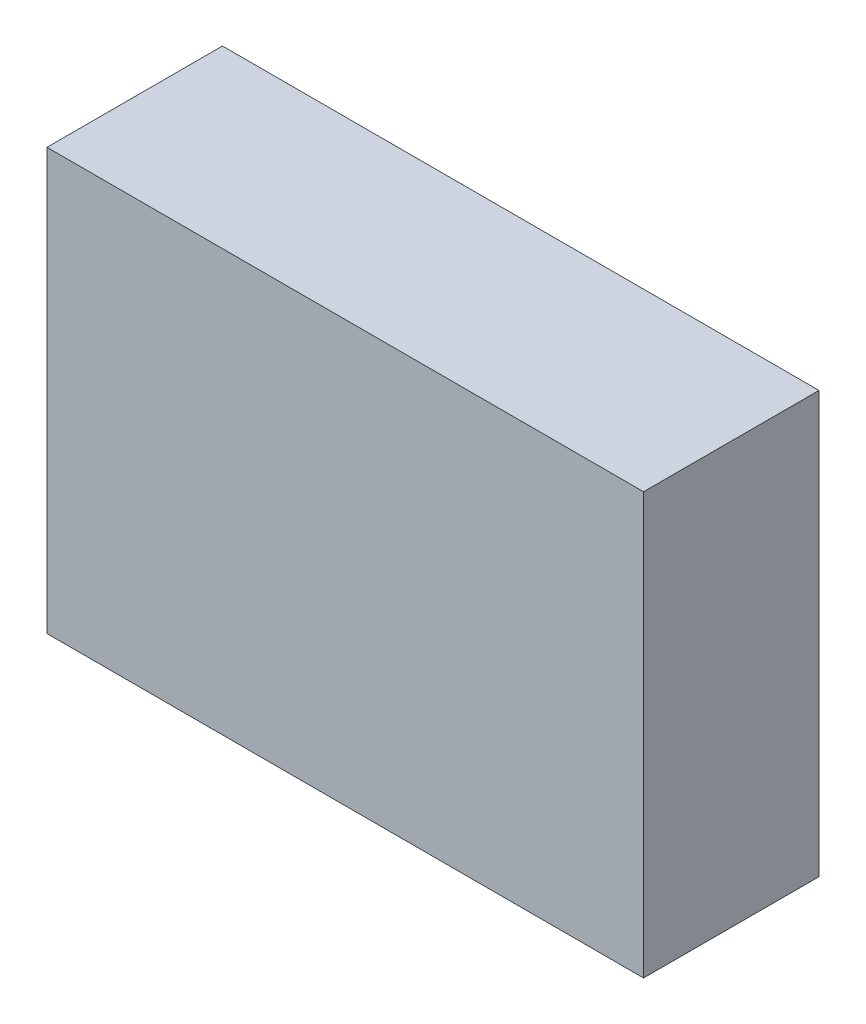
ISO-10303-21;
HEADER;
FILE_DESCRIPTION(('STEP AP214'),'2;1');
FILE_NAME('part.step','',(''),(''),'','','');
FILE_SCHEMA(('AUTOMOTIVE_DESIGN { 1 0 10303 214 1 1 1 1 }'));
ENDSEC;
DATA;
#1=APPLICATION_CONTEXT('core data for automotive mechanical design processes');
#2=APPLICATION_PROTOCOL_DEFINITION('international standard','automotive_design',2000,#1);
#3=PRODUCT_CONTEXT('',#1,'mechanical');
#4=PRODUCT('Part','Part','',(#3));
#5=PRODUCT_RELATED_PRODUCT_CATEGORY('part','',(#4));
#6=PRODUCT_DEFINITION_FORMATION('','',#4);
#7=PRODUCT_DEFINITION_CONTEXT('part definition',#1,'design');
#8=PRODUCT_DEFINITION('design','',#6,#7);
#9=PRODUCT_DEFINITION_SHAPE('','',#8);
#10=(LENGTH_UNIT() NAMED_UNIT(*) SI_UNIT(.MILLI.,.METRE.));
#11=(NAMED_UNIT(*) PLANE_ANGLE_UNIT() SI_UNIT($,.RADIAN.));
#12=(NAMED_UNIT(*) SI_UNIT($,.STERADIAN.) SOLID_ANGLE_UNIT());
#13=UNCERTAINTY_MEASURE_WITH_UNIT(LENGTH_MEASURE(1.E-05),#10,'distance_accuracy_value','');
#14=(GEOMETRIC_REPRESENTATION_CONTEXT(3) GLOBAL_UNCERTAINTY_ASSIGNED_CONTEXT((#13)) GLOBAL_UNIT_ASSIGNED_CONTEXT((#10,
#11,#12)) REPRESENTATION_CONTEXT('',''));
#15=CARTESIAN_POINT('',(0.,0.,0.));
#16=DIRECTION('',(0.,0.,1.));
#17=DIRECTION('',(1.,0.,0.));
#18=AXIS2_PLACEMENT_3D('',#15,#16,#17);
#19=CARTESIAN_POINT('',(2.58,2.13,0.));
#20=DIRECTION('',(1.,0.,0.));
#21=DIRECTION('',(0.,0.,1.));
#22=AXIS2_PLACEMENT_3D('',#19,#20,#21);
#23=PLANE('',#22);
#24=DIRECTION('',(0.,1.,0.));
#25=VECTOR('',#24,1.);
#26=CARTESIAN_POINT('',(2.58,2.13,0.1));
#27=LINE('',#26,#25);
#28=CARTESIAN_POINT('',(2.58,2.13,0.1));
#29=VERTEX_POINT('',#28);
#30=CARTESIAN_POINT('',(2.58,2.37,0.1));
#31=VERTEX_POINT('',#30);
#32=EDGE_CURVE('E11',#29,#31,#27,.T.);
#33=ORIENTED_EDGE('',*,*,#32,.T.);
#34=DIRECTION('',(0.,0.,1.));
#35=VECTOR('',#34,1.);
#36=CARTESIAN_POINT('',(2.58,2.37,0.));
#37=LINE('',#36,#35);
#38=CARTESIAN_POINT('',(2.58,2.37,0.));
#39=VERTEX_POINT('',#38);
#40=EDGE_CURVE('E24',#39,#31,#37,.T.);
#41=ORIENTED_EDGE('',*,*,#40,.F.);
#42=DIRECTION('',(0.,1.,0.));
#43=VECTOR('',#42,1.);
#44=CARTESIAN_POINT('',(2.58,2.13,0.));
#45=LINE('',#44,#43);
#46=CARTESIAN_POINT('',(2.58,2.13,0.));
#47=VERTEX_POINT('',#46);
#48=EDGE_CURVE('E86',#47,#39,#45,.T.);
#49=ORIENTED_EDGE('',*,*,#48,.F.);
#50=DIRECTION('',(0.,0.,1.));
#51=VECTOR('',#50,1.);
#52=CARTESIAN_POINT('',(2.58,2.13,0.));
#53=LINE('',#52,#51);
#54=EDGE_CURVE('E36',#47,#29,#53,.T.);
#55=ORIENTED_EDGE('',*,*,#54,.T.);
#56=EDGE_LOOP('',(#33,#41,#49,#55));
#57=FACE_BOUND('',#56,.T.);
#58=ADVANCED_FACE('F17',(#57),#23,.F.);
#59=CARTESIAN_POINT('',(2.92,2.13,0.));
#60=DIRECTION('',(1.,0.,0.));
#61=DIRECTION('',(0.,0.,1.));
#62=AXIS2_PLACEMENT_3D('',#59,#60,#61);
#63=PLANE('',#62);
#64=DIRECTION('',(0.,0.,1.));
#65=VECTOR('',#64,1.);
#66=CARTESIAN_POINT('',(2.92,2.13,0.));
#67=LINE('',#66,#65);
#68=CARTESIAN_POINT('',(2.92,2.13,0.));
#69=VERTEX_POINT('',#68);
#70=CARTESIAN_POINT('',(2.92,2.13,0.1));
#71=VERTEX_POINT('',#70);
#72=EDGE_CURVE('E83',#69,#71,#67,.T.);
#73=ORIENTED_EDGE('',*,*,#72,.F.);
#74=DIRECTION('',(0.,1.,0.));
#75=VECTOR('',#74,1.);
#76=CARTESIAN_POINT('',(2.92,2.13,0.));
#77=LINE('',#76,#75);
#78=CARTESIAN_POINT('',(2.92,2.37,0.));
#79=VERTEX_POINT('',#78);
#80=EDGE_CURVE('E63',#69,#79,#77,.T.);
#81=ORIENTED_EDGE('',*,*,#80,.T.);
#82=DIRECTION('',(0.,0.,1.));
#83=VECTOR('',#82,1.);
#84=CARTESIAN_POINT('',(2.92,2.37,0.));
#85=LINE('',#84,#83);
#86=CARTESIAN_POINT('',(2.92,2.37,0.1));
#87=VERTEX_POINT('',#86);
#88=EDGE_CURVE('E57',#79,#87,#85,.T.);
#89=ORIENTED_EDGE('',*,*,#88,.T.);
#90=DIRECTION('',(0.,1.,0.));
#91=VECTOR('',#90,1.);
#92=CARTESIAN_POINT('',(2.92,2.13,0.1));
#93=LINE('',#92,#91);
#94=EDGE_CURVE('E60',#71,#87,#93,.T.);
#95=ORIENTED_EDGE('',*,*,#94,.F.);
#96=EDGE_LOOP('',(#73,#81,#89,#95));
#97=FACE_BOUND('',#96,.T.);
#98=ADVANCED_FACE('F59',(#97),#63,.T.);
#99=CARTESIAN_POINT('',(2.58,2.13,0.));
#100=DIRECTION('',(0.,1.,0.));
#101=DIRECTION('',(0.,0.,1.));
#102=AXIS2_PLACEMENT_3D('',#99,#100,#101);
#103=PLANE('',#102);
#104=ORIENTED_EDGE('',*,*,#72,.T.);
#105=DIRECTION('',(1.,0.,0.));
#106=VECTOR('',#105,1.);
#107=CARTESIAN_POINT('',(2.58,2.13,0.1));
#108=LINE('',#107,#106);
#109=EDGE_CURVE('E71',#29,#71,#108,.T.);
#110=ORIENTED_EDGE('',*,*,#109,.F.);
#111=ORIENTED_EDGE('',*,*,#54,.F.);
#112=DIRECTION('',(1.,0.,0.));
#113=VECTOR('',#112,1.);
#114=CARTESIAN_POINT('',(2.58,2.13,0.));
#115=LINE('',#114,#113);
#116=EDGE_CURVE('E76',#47,#69,#115,.T.);
#117=ORIENTED_EDGE('',*,*,#116,.T.);
#118=EDGE_LOOP('',(#104,#110,#111,#117));
#119=FACE_BOUND('',#118,.T.);
#120=ADVANCED_FACE('F91',(#119),#103,.F.);
#121=CARTESIAN_POINT('',(2.58,2.37,0.));
#122=DIRECTION('',(0.,1.,0.));
#123=DIRECTION('',(0.,0.,1.));
#124=AXIS2_PLACEMENT_3D('',#121,#122,#123);
#125=PLANE('',#124);
#126=DIRECTION('',(1.,0.,0.));
#127=VECTOR('',#126,1.);
#128=CARTESIAN_POINT('',(2.58,2.37,0.));
#129=LINE('',#128,#127);
#130=EDGE_CURVE('E74',#39,#79,#129,.T.);
#131=ORIENTED_EDGE('',*,*,#130,.F.);
#132=ORIENTED_EDGE('',*,*,#40,.T.);
#133=DIRECTION('',(1.,0.,0.));
#134=VECTOR('',#133,1.);
#135=CARTESIAN_POINT('',(2.58,2.37,0.1));
#136=LINE('',#135,#134);
#137=EDGE_CURVE('E69',#31,#87,#136,.T.);
#138=ORIENTED_EDGE('',*,*,#137,.T.);
#139=ORIENTED_EDGE('',*,*,#88,.F.);
#140=EDGE_LOOP('',(#131,#132,#138,#139));
#141=FACE_BOUND('',#140,.T.);
#142=ADVANCED_FACE('F73',(#141),#125,.T.);
#143=CARTESIAN_POINT('',(2.58,2.13,0.));
#144=DIRECTION('',(0.,0.,1.));
#145=DIRECTION('',(1.,0.,0.));
#146=AXIS2_PLACEMENT_3D('',#143,#144,#145);
#147=PLANE('',#146);
#148=ORIENTED_EDGE('',*,*,#130,.T.);
#149=ORIENTED_EDGE('',*,*,#80,.F.);
#150=ORIENTED_EDGE('',*,*,#116,.F.);
#151=ORIENTED_EDGE('',*,*,#48,.T.);
#152=EDGE_LOOP('',(#148,#149,#150,#151));
#153=FACE_BOUND('',#152,.T.);
#154=ADVANCED_FACE('F89',(#153),#147,.F.);
#155=CARTESIAN_POINT('',(2.58,2.13,0.1));
#156=DIRECTION('',(0.,0.,1.));
#157=DIRECTION('',(1.,0.,0.));
#158=AXIS2_PLACEMENT_3D('',#155,#156,#157);
#159=PLANE('',#158);
#160=ORIENTED_EDGE('',*,*,#32,.F.);
#161=ORIENTED_EDGE('',*,*,#109,.T.);
#162=ORIENTED_EDGE('',*,*,#94,.T.);
#163=ORIENTED_EDGE('',*,*,#137,.F.);
#164=EDGE_LOOP('',(#160,#161,#162,#163));
#165=FACE_BOUND('',#164,.T.);
#166=ADVANCED_FACE('F68',(#165),#159,.T.);
#167=CLOSED_SHELL('',(#58,#98,#120,#142,#154,#166));
#168=MANIFOLD_SOLID_BREP('B1',#167);
#169=ADVANCED_BREP_SHAPE_REPRESENTATION('',(#18,#168),#14);
#170=SHAPE_DEFINITION_REPRESENTATION(#9,#169);
ENDSEC;
END-ISO-10303-21;
